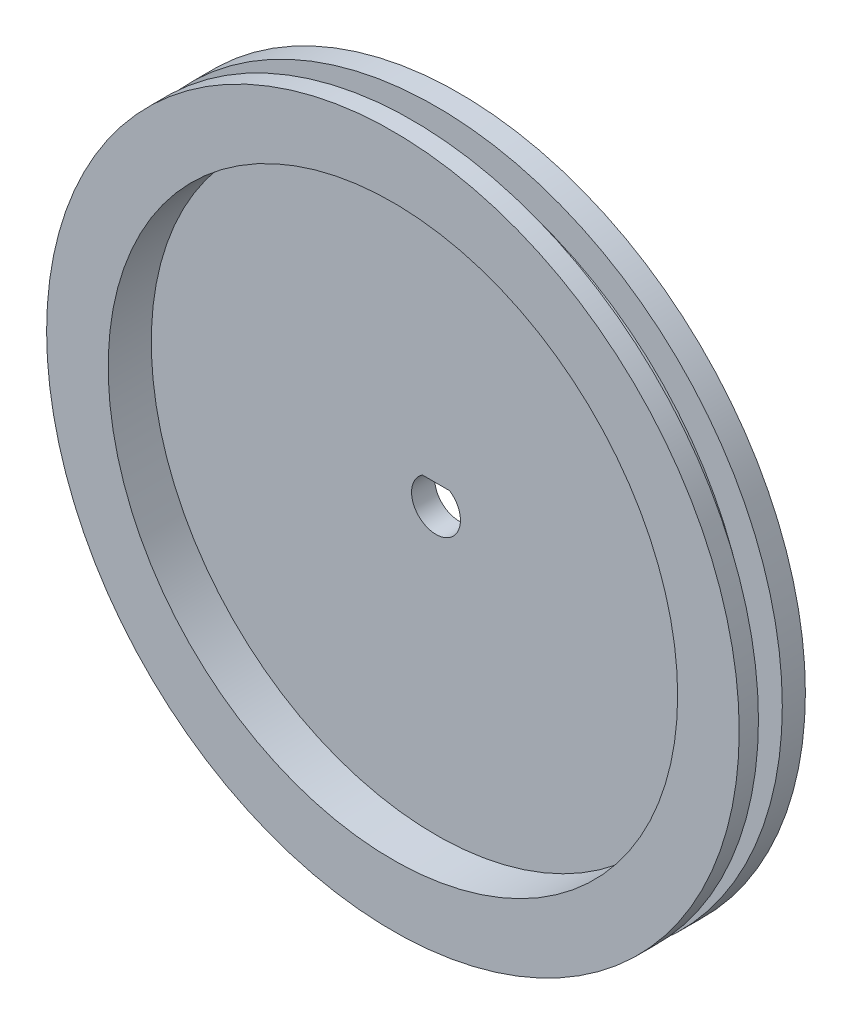
ISO-10303-21;
HEADER;
FILE_DESCRIPTION(('STEP AP214'),'2;1');
FILE_NAME('part.step','',(''),(''),'','','');
FILE_SCHEMA(('AUTOMOTIVE_DESIGN { 1 0 10303 214 1 1 1 1 }'));
ENDSEC;
DATA;
#1=APPLICATION_CONTEXT('core data for automotive mechanical design processes');
#2=APPLICATION_PROTOCOL_DEFINITION('international standard','automotive_design',2000,#1);
#3=PRODUCT_CONTEXT('',#1,'mechanical');
#4=PRODUCT('Part','Part','',(#3));
#5=PRODUCT_RELATED_PRODUCT_CATEGORY('part','',(#4));
#6=PRODUCT_DEFINITION_FORMATION('','',#4);
#7=PRODUCT_DEFINITION_CONTEXT('part definition',#1,'design');
#8=PRODUCT_DEFINITION('design','',#6,#7);
#9=PRODUCT_DEFINITION_SHAPE('','',#8);
#10=(LENGTH_UNIT() NAMED_UNIT(*) SI_UNIT(.MILLI.,.METRE.));
#11=(NAMED_UNIT(*) PLANE_ANGLE_UNIT() SI_UNIT($,.RADIAN.));
#12=(NAMED_UNIT(*) SI_UNIT($,.STERADIAN.) SOLID_ANGLE_UNIT());
#13=UNCERTAINTY_MEASURE_WITH_UNIT(LENGTH_MEASURE(1.E-05),#10,'distance_accuracy_value','');
#14=(GEOMETRIC_REPRESENTATION_CONTEXT(3) GLOBAL_UNCERTAINTY_ASSIGNED_CONTEXT((#13)) GLOBAL_UNIT_ASSIGNED_CONTEXT((#10,
#11,#12)) REPRESENTATION_CONTEXT('',''));
#15=CARTESIAN_POINT('',(0.,0.,0.));
#16=DIRECTION('',(0.,0.,1.));
#17=DIRECTION('',(1.,0.,0.));
#18=AXIS2_PLACEMENT_3D('',#15,#16,#17);
#19=CARTESIAN_POINT('',(0.,0.,0.));
#20=DIRECTION('',(0.,0.,1.));
#21=DIRECTION('',(1.,0.,0.));
#22=AXIS2_PLACEMENT_3D('',#19,#20,#21);
#23=PLANE('',#22);
#24=CARTESIAN_POINT('',(0.,0.,0.));
#25=DIRECTION('',(0.,0.,1.));
#26=DIRECTION('',(1.,0.,0.));
#27=AXIS2_PLACEMENT_3D('',#24,#25,#26);
#28=CIRCLE('',#27,3.175);
#29=CARTESIAN_POINT('',(-1.77868631298495,2.63,0.));
#30=VERTEX_POINT('',#29);
#31=CARTESIAN_POINT('',(1.77868631298495,2.63,0.));
#32=VERTEX_POINT('',#31);
#33=EDGE_CURVE('E82',#30,#32,#28,.T.);
#34=ORIENTED_EDGE('',*,*,#33,.T.);
#35=DIRECTION('',(1.,0.,0.));
#36=VECTOR('',#35,1.);
#37=CARTESIAN_POINT('',(0.,2.63,0.));
#38=LINE('',#37,#36);
#39=EDGE_CURVE('E49',#30,#32,#38,.T.);
#40=ORIENTED_EDGE('',*,*,#39,.F.);
#41=EDGE_LOOP('',(#34,#40));
#42=FACE_BOUND('',#41,.T.);
#43=CARTESIAN_POINT('',(0.,0.,0.));
#44=DIRECTION('',(0.,0.,1.));
#45=DIRECTION('',(1.,0.,0.));
#46=AXIS2_PLACEMENT_3D('',#43,#44,#45);
#47=CIRCLE('',#46,45.);
#48=CARTESIAN_POINT('',(45.,0.,0.));
#49=VERTEX_POINT('',#48);
#50=EDGE_CURVE('E77',#49,#49,#47,.T.);
#51=ORIENTED_EDGE('',*,*,#50,.F.);
#52=EDGE_LOOP('',(#51));
#53=FACE_BOUND('',#52,.T.);
#54=ADVANCED_FACE('F35',(#42,#53),#23,.F.);
#55=CARTESIAN_POINT('',(0.,0.,6.1));
#56=DIRECTION('',(0.,0.,1.));
#57=DIRECTION('',(1.,0.,0.));
#58=AXIS2_PLACEMENT_3D('',#55,#56,#57);
#59=CYLINDRICAL_SURFACE('',#58,45.);
#60=CARTESIAN_POINT('',(0.,0.,6.1));
#61=DIRECTION('',(0.,0.,1.));
#62=DIRECTION('',(1.,0.,0.));
#63=AXIS2_PLACEMENT_3D('',#60,#61,#62);
#64=CIRCLE('',#63,45.);
#65=CARTESIAN_POINT('',(45.,0.,6.1));
#66=VERTEX_POINT('',#65);
#67=EDGE_CURVE('E136',#66,#66,#64,.T.);
#68=ORIENTED_EDGE('',*,*,#67,.T.);
#69=EDGE_LOOP('',(#68));
#70=FACE_BOUND('',#69,.T.);
#71=CARTESIAN_POINT('',(0.,0.,8.6));
#72=DIRECTION('',(0.,0.,1.));
#73=DIRECTION('',(1.,0.,0.));
#74=AXIS2_PLACEMENT_3D('',#71,#72,#73);
#75=CIRCLE('',#74,45.);
#76=CARTESIAN_POINT('',(45.,0.,8.6));
#77=VERTEX_POINT('',#76);
#78=EDGE_CURVE('E73',#77,#77,#75,.T.);
#79=ORIENTED_EDGE('',*,*,#78,.F.);
#80=EDGE_LOOP('',(#79));
#81=FACE_BOUND('',#80,.T.);
#82=ADVANCED_FACE('F107',(#70,#81),#59,.T.);
#83=CARTESIAN_POINT('',(0.,0.,8.6));
#84=DIRECTION('',(0.,0.,1.));
#85=DIRECTION('',(1.,0.,0.));
#86=AXIS2_PLACEMENT_3D('',#83,#84,#85);
#87=PLANE('',#86);
#88=CARTESIAN_POINT('',(0.,0.,8.6));
#89=DIRECTION('',(0.,0.,1.));
#90=DIRECTION('',(1.,0.,0.));
#91=AXIS2_PLACEMENT_3D('',#88,#89,#90);
#92=CIRCLE('',#91,37.);
#93=CARTESIAN_POINT('',(37.,0.,8.6));
#94=VERTEX_POINT('',#93);
#95=EDGE_CURVE('E137',#94,#94,#92,.T.);
#96=ORIENTED_EDGE('',*,*,#95,.F.);
#97=EDGE_LOOP('',(#96));
#98=FACE_BOUND('',#97,.T.);
#99=ORIENTED_EDGE('',*,*,#78,.T.);
#100=EDGE_LOOP('',(#99));
#101=FACE_BOUND('',#100,.T.);
#102=ADVANCED_FACE('F109',(#98,#101),#87,.T.);
#103=CARTESIAN_POINT('',(0.,0.,8.6));
#104=DIRECTION('',(0.,0.,-1.));
#105=DIRECTION('',(-1.,0.,0.));
#106=AXIS2_PLACEMENT_3D('',#103,#104,#105);
#107=CYLINDRICAL_SURFACE('',#106,37.);
#108=ORIENTED_EDGE('',*,*,#95,.T.);
#109=EDGE_LOOP('',(#108));
#110=FACE_BOUND('',#109,.T.);
#111=CARTESIAN_POINT('',(0.,0.,3.));
#112=DIRECTION('',(0.,0.,1.));
#113=DIRECTION('',(1.,0.,0.));
#114=AXIS2_PLACEMENT_3D('',#111,#112,#113);
#115=CIRCLE('',#114,37.);
#116=CARTESIAN_POINT('',(37.,0.,3.));
#117=VERTEX_POINT('',#116);
#118=EDGE_CURVE('E43',#117,#117,#115,.F.);
#119=ORIENTED_EDGE('',*,*,#118,.T.);
#120=EDGE_LOOP('',(#119));
#121=FACE_BOUND('',#120,.T.);
#122=ADVANCED_FACE('F91',(#110,#121),#107,.F.);
#123=CARTESIAN_POINT('',(0.,0.,3.));
#124=DIRECTION('',(0.,0.,-1.));
#125=DIRECTION('',(-1.,0.,0.));
#126=AXIS2_PLACEMENT_3D('',#123,#124,#125);
#127=CYLINDRICAL_SURFACE('',#126,3.175);
#128=CARTESIAN_POINT('',(0.,0.,3.));
#129=DIRECTION('',(0.,0.,1.));
#130=DIRECTION('',(1.,0.,0.));
#131=AXIS2_PLACEMENT_3D('',#128,#129,#130);
#132=CIRCLE('',#131,3.175);
#133=CARTESIAN_POINT('',(-1.77868631298495,2.63,3.));
#134=VERTEX_POINT('',#133);
#135=CARTESIAN_POINT('',(1.77868631298495,2.63,3.));
#136=VERTEX_POINT('',#135);
#137=EDGE_CURVE('E72',#134,#136,#132,.T.);
#138=ORIENTED_EDGE('',*,*,#137,.T.);
#139=DIRECTION('',(0.,0.,-1.));
#140=VECTOR('',#139,1.);
#141=CARTESIAN_POINT('',(1.77868631298495,2.63,6.59887829746992));
#142=LINE('',#141,#140);
#143=EDGE_CURVE('E62',#136,#32,#142,.T.);
#144=ORIENTED_EDGE('',*,*,#143,.T.);
#145=ORIENTED_EDGE('',*,*,#33,.F.);
#146=DIRECTION('',(0.,0.,-1.));
#147=VECTOR('',#146,1.);
#148=CARTESIAN_POINT('',(-1.77868631298495,2.63,6.59887829746992));
#149=LINE('',#148,#147);
#150=EDGE_CURVE('E75',#134,#30,#149,.T.);
#151=ORIENTED_EDGE('',*,*,#150,.F.);
#152=EDGE_LOOP('',(#138,#144,#145,#151));
#153=FACE_BOUND('',#152,.T.);
#154=ADVANCED_FACE('F37',(#153),#127,.F.);
#155=CARTESIAN_POINT('',(0.,0.,3.));
#156=DIRECTION('',(0.,0.,1.));
#157=DIRECTION('',(1.,0.,0.));
#158=AXIS2_PLACEMENT_3D('',#155,#156,#157);
#159=PLANE('',#158);
#160=ORIENTED_EDGE('',*,*,#137,.F.);
#161=DIRECTION('',(1.,0.,0.));
#162=VECTOR('',#161,1.);
#163=CARTESIAN_POINT('',(0.,2.63,3.));
#164=LINE('',#163,#162);
#165=EDGE_CURVE('E56',#134,#136,#164,.T.);
#166=ORIENTED_EDGE('',*,*,#165,.T.);
#167=EDGE_LOOP('',(#160,#166));
#168=FACE_BOUND('',#167,.T.);
#169=ORIENTED_EDGE('',*,*,#118,.F.);
#170=EDGE_LOOP('',(#169));
#171=FACE_BOUND('',#170,.T.);
#172=ADVANCED_FACE('F70',(#168,#171),#159,.T.);
#173=CARTESIAN_POINT('',(0.,2.63,6.59887829746992));
#174=DIRECTION('',(0.,1.,0.));
#175=DIRECTION('',(0.,0.,1.));
#176=AXIS2_PLACEMENT_3D('',#173,#174,#175);
#177=PLANE('',#176);
#178=ORIENTED_EDGE('',*,*,#165,.F.);
#179=ORIENTED_EDGE('',*,*,#150,.T.);
#180=ORIENTED_EDGE('',*,*,#39,.T.);
#181=ORIENTED_EDGE('',*,*,#143,.F.);
#182=EDGE_LOOP('',(#178,#179,#180,#181));
#183=FACE_BOUND('',#182,.T.);
#184=ADVANCED_FACE('F63',(#183),#177,.F.);
#185=CARTESIAN_POINT('',(0.,0.,6.1));
#186=DIRECTION('',(0.,0.,1.));
#187=DIRECTION('',(1.,0.,0.));
#188=AXIS2_PLACEMENT_3D('',#185,#186,#187);
#189=PLANE('',#188);
#190=CARTESIAN_POINT('',(0.,0.,6.1));
#191=DIRECTION('',(0.,0.,1.));
#192=DIRECTION('',(1.,0.,0.));
#193=AXIS2_PLACEMENT_3D('',#190,#191,#192);
#194=CIRCLE('',#193,41.);
#195=CARTESIAN_POINT('',(41.,0.,6.1));
#196=VERTEX_POINT('',#195);
#197=EDGE_CURVE('E11',#196,#196,#194,.T.);
#198=ORIENTED_EDGE('',*,*,#197,.T.);
#199=EDGE_LOOP('',(#198));
#200=FACE_BOUND('',#199,.T.);
#201=ORIENTED_EDGE('',*,*,#67,.F.);
#202=EDGE_LOOP('',(#201));
#203=FACE_BOUND('',#202,.T.);
#204=ADVANCED_FACE('F99',(#200,#203),#189,.F.);
#205=CARTESIAN_POINT('',(0.,0.,8.6));
#206=DIRECTION('',(0.,0.,-1.));
#207=DIRECTION('',(-1.,0.,0.));
#208=AXIS2_PLACEMENT_3D('',#205,#206,#207);
#209=CYLINDRICAL_SURFACE('',#208,41.);
#210=CARTESIAN_POINT('',(0.,0.,3.));
#211=DIRECTION('',(0.,0.,1.));
#212=DIRECTION('',(1.,0.,0.));
#213=AXIS2_PLACEMENT_3D('',#210,#211,#212);
#214=CIRCLE('',#213,41.);
#215=CARTESIAN_POINT('',(41.,0.,3.));
#216=VERTEX_POINT('',#215);
#217=EDGE_CURVE('E85',#216,#216,#214,.T.);
#218=ORIENTED_EDGE('',*,*,#217,.T.);
#219=EDGE_LOOP('',(#218));
#220=FACE_BOUND('',#219,.T.);
#221=ORIENTED_EDGE('',*,*,#197,.F.);
#222=EDGE_LOOP('',(#221));
#223=FACE_BOUND('',#222,.T.);
#224=ADVANCED_FACE('F105',(#220,#223),#209,.T.);
#225=ORIENTED_EDGE('',*,*,#217,.F.);
#226=EDGE_LOOP('',(#225));
#227=FACE_BOUND('',#226,.T.);
#228=CARTESIAN_POINT('',(0.,0.,3.));
#229=DIRECTION('',(0.,0.,1.));
#230=DIRECTION('',(1.,0.,0.));
#231=AXIS2_PLACEMENT_3D('',#228,#229,#230);
#232=CIRCLE('',#231,45.);
#233=CARTESIAN_POINT('',(45.,0.,3.));
#234=VERTEX_POINT('',#233);
#235=EDGE_CURVE('E76',#234,#234,#232,.T.);
#236=ORIENTED_EDGE('',*,*,#235,.T.);
#237=EDGE_LOOP('',(#236));
#238=FACE_BOUND('',#237,.T.);
#239=ADVANCED_FACE('F94',(#227,#238),#159,.T.);
#240=CARTESIAN_POINT('',(0.,0.,3.));
#241=DIRECTION('',(0.,0.,-1.));
#242=DIRECTION('',(-1.,0.,0.));
#243=AXIS2_PLACEMENT_3D('',#240,#241,#242);
#244=CYLINDRICAL_SURFACE('',#243,45.);
#245=ORIENTED_EDGE('',*,*,#235,.F.);
#246=EDGE_LOOP('',(#245));
#247=FACE_BOUND('',#246,.T.);
#248=ORIENTED_EDGE('',*,*,#50,.T.);
#249=EDGE_LOOP('',(#248));
#250=FACE_BOUND('',#249,.T.);
#251=ADVANCED_FACE('F104',(#247,#250),#244,.T.);
#252=CLOSED_SHELL('',(#54,#82,#102,#122,#154,#172,#184,#204,#224,#239,#251));
#253=MANIFOLD_SOLID_BREP('B2',#252);
#254=ADVANCED_BREP_SHAPE_REPRESENTATION('',(#18,#253),#14);
#255=SHAPE_DEFINITION_REPRESENTATION(#9,#254);
ENDSEC;
END-ISO-10303-21;
